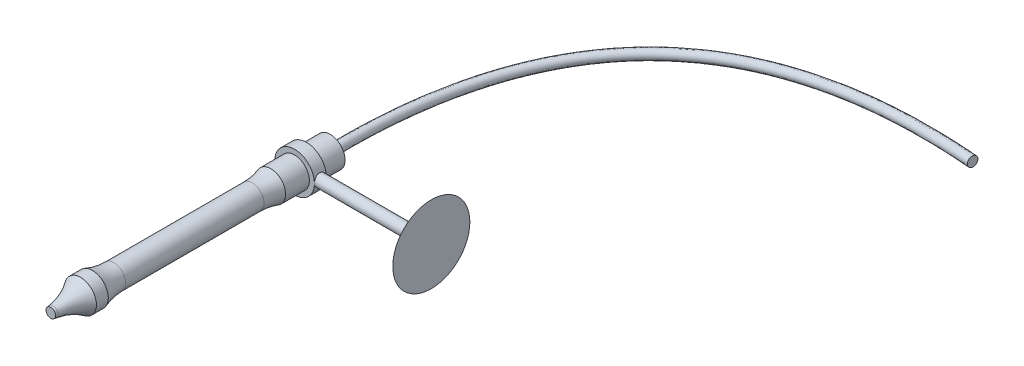
ISO-10303-21;
HEADER;
FILE_DESCRIPTION(('STEP AP214'),'2;1');
FILE_NAME('part.step','',(''),(''),'','','');
FILE_SCHEMA(('AUTOMOTIVE_DESIGN { 1 0 10303 214 1 1 1 1 }'));
ENDSEC;
DATA;
#1=APPLICATION_CONTEXT('core data for automotive mechanical design processes');
#2=APPLICATION_PROTOCOL_DEFINITION('international standard','automotive_design',2000,#1);
#3=PRODUCT_CONTEXT('',#1,'mechanical');
#4=PRODUCT('Part','Part','',(#3));
#5=PRODUCT_RELATED_PRODUCT_CATEGORY('part','',(#4));
#6=PRODUCT_DEFINITION_FORMATION('','',#4);
#7=PRODUCT_DEFINITION_CONTEXT('part definition',#1,'design');
#8=PRODUCT_DEFINITION('design','',#6,#7);
#9=PRODUCT_DEFINITION_SHAPE('','',#8);
#10=(LENGTH_UNIT() NAMED_UNIT(*) SI_UNIT(.MILLI.,.METRE.));
#11=(NAMED_UNIT(*) PLANE_ANGLE_UNIT() SI_UNIT($,.RADIAN.));
#12=(NAMED_UNIT(*) SI_UNIT($,.STERADIAN.) SOLID_ANGLE_UNIT());
#13=UNCERTAINTY_MEASURE_WITH_UNIT(LENGTH_MEASURE(1.E-05),#10,'distance_accuracy_value','');
#14=(GEOMETRIC_REPRESENTATION_CONTEXT(3) GLOBAL_UNCERTAINTY_ASSIGNED_CONTEXT((#13)) GLOBAL_UNIT_ASSIGNED_CONTEXT((#10,
#11,#12)) REPRESENTATION_CONTEXT('',''));
#15=CARTESIAN_POINT('',(0.,0.,0.));
#16=DIRECTION('',(0.,0.,1.));
#17=DIRECTION('',(1.,0.,0.));
#18=AXIS2_PLACEMENT_3D('',#15,#16,#17);
#19=CARTESIAN_POINT('',(0.,0.,4.));
#20=DIRECTION('',(0.,0.,1.));
#21=DIRECTION('',(1.,0.,0.));
#22=AXIS2_PLACEMENT_3D('',#19,#20,#21);
#23=CYLINDRICAL_SURFACE('',#22,3.33545911406675);
#24=CARTESIAN_POINT('',(0.,0.,4.));
#25=DIRECTION('',(0.,0.,-1.));
#26=DIRECTION('',(-1.,0.,0.));
#27=AXIS2_PLACEMENT_3D('',#24,#25,#26);
#28=CIRCLE('',#27,3.33545911406675);
#29=CARTESIAN_POINT('',(-3.33545911406675,0.,4.));
#30=VERTEX_POINT('',#29);
#31=EDGE_CURVE('E62',#30,#30,#28,.T.);
#32=ORIENTED_EDGE('',*,*,#31,.F.);
#33=EDGE_LOOP('',(#32));
#34=FACE_BOUND('',#33,.T.);
#35=CARTESIAN_POINT('',(0.,0.,6.));
#36=DIRECTION('',(0.,0.,-1.));
#37=DIRECTION('',(-1.,0.,0.));
#38=AXIS2_PLACEMENT_3D('',#35,#36,#37);
#39=CIRCLE('',#38,3.33545911406675);
#40=CARTESIAN_POINT('',(-3.33545911406675,0.,6.));
#41=VERTEX_POINT('',#40);
#42=EDGE_CURVE('E61',#41,#41,#39,.T.);
#43=ORIENTED_EDGE('',*,*,#42,.T.);
#44=EDGE_LOOP('',(#43));
#45=FACE_BOUND('',#44,.T.);
#46=CARTESIAN_POINT('',(3.33545911406675,0.,4.0123615803254));
#47=CARTESIAN_POINT('',(3.33545859474532,0.0542133240496529,4.01236232387684));
#48=CARTESIAN_POINT('',(3.33412468721525,0.108434184529217,4.01684020928572));
#49=CARTESIAN_POINT('',(3.32893368200549,0.215299004095399,4.03459226151468));
#50=CARTESIAN_POINT('',(3.32507577599388,0.267942452351953,4.04786924633869));
#51=CARTESIAN_POINT('',(3.31525987532415,0.370095511714682,4.08273883298903));
#52=CARTESIAN_POINT('',(3.30930493320031,0.419609555205668,4.10431935204747));
#53=CARTESIAN_POINT('',(3.295915162992,0.514316292113763,4.15513443939346));
#54=CARTESIAN_POINT('',(3.28848014949565,0.559508443066529,4.18436996678603));
#55=CARTESIAN_POINT('',(3.2726913390432,0.645555869772041,4.25052926292948));
#56=CARTESIAN_POINT('',(3.26431908206602,0.686272814123452,4.28762853201235));
#57=CARTESIAN_POINT('',(3.24771050900459,0.761007605381701,4.36808802331961));
#58=CARTESIAN_POINT('',(3.23947421528625,0.795024359974312,4.41144926442295));
#59=CARTESIAN_POINT('',(3.22387562790301,0.856114461558237,4.50436413942261));
#60=CARTESIAN_POINT('',(3.21653631853401,0.883020160804385,4.55403221935504));
#61=CARTESIAN_POINT('',(3.20383804372948,0.928041146304969,4.65744033353634));
#62=CARTESIAN_POINT('',(3.19847861665757,0.946158481994202,4.71117941505015));
#63=CARTESIAN_POINT('',(3.19053907662252,0.972591882833786,4.81965319708747));
#64=CARTESIAN_POINT('',(3.187886954268,0.981162475167788,4.87432046286353));
#65=CARTESIAN_POINT('',(3.1854479682639,0.989053755209431,4.98437632294314));
#66=CARTESIAN_POINT('',(3.18566043049727,0.988376619166253,5.03976474447351));
#67=CARTESIAN_POINT('',(3.18886271192411,0.977991844593223,5.14763132795278));
#68=CARTESIAN_POINT('',(3.19175487801695,0.968601705709039,5.20014343374472));
#69=CARTESIAN_POINT('',(3.19983290829458,0.941569905030586,5.30281084822294));
#70=CARTESIAN_POINT('',(3.20501899356802,0.923927447865862,5.35296592922286));
#71=CARTESIAN_POINT('',(3.21717940817788,0.880654971952299,5.45027836957983));
#72=CARTESIAN_POINT('',(3.22417679383611,0.854920973550015,5.49738648761944));
#73=CARTESIAN_POINT('',(3.23916013869764,0.796268204725903,5.58672277360935));
#74=CARTESIAN_POINT('',(3.24714633194111,0.763347731930148,5.62894978166258));
#75=CARTESIAN_POINT('',(3.26360477993206,0.689673939290382,5.70912766637599));
#76=CARTESIAN_POINT('',(3.27208360044128,0.648656736973535,5.74683512711562));
#77=CARTESIAN_POINT('',(3.28828403325024,0.560775574965283,5.81489214578275));
#78=CARTESIAN_POINT('',(3.29600560029437,0.51391126621399,5.84524126411412));
#79=CARTESIAN_POINT('',(3.30988897215643,0.415231866699017,5.89786278978185));
#80=CARTESIAN_POINT('',(3.3160405095211,0.363387092625176,5.92008242282251));
#81=CARTESIAN_POINT('',(3.3260167285635,0.256472291165546,5.95541562769836));
#82=CARTESIAN_POINT('',(3.32984204182267,0.201403143668695,5.96853167134033));
#83=CARTESIAN_POINT('',(3.33463543982902,0.0916731109890746,5.98488297386323));
#84=CARTESIAN_POINT('',(3.33569891673489,0.0370654964326703,5.98844825323522));
#85=CARTESIAN_POINT('',(3.33512799089891,-0.0719707270611069,5.98652015591804));
#86=CARTESIAN_POINT('',(3.33349393812181,-0.126399358301029,5.98102795430376));
#87=CARTESIAN_POINT('',(3.32777391494358,-0.232295271324664,5.96140817595549));
#88=CARTESIAN_POINT('',(3.32374243036412,-0.283801303316338,5.94747236605191));
#89=CARTESIAN_POINT('',(3.31369283249739,-0.383733818374663,5.91159069194744));
#90=CARTESIAN_POINT('',(3.3076744827287,-0.432159934043683,5.88964387422449));
#91=CARTESIAN_POINT('',(3.2941056600938,-0.525780656750882,5.83780218218657));
#92=CARTESIAN_POINT('',(3.28652346492846,-0.570876763874594,5.80773795131983));
#93=CARTESIAN_POINT('',(3.27069835550213,-0.655496754229677,5.74072147237581));
#94=CARTESIAN_POINT('',(3.26245528011169,-0.695019272042243,5.70376754158952));
#95=CARTESIAN_POINT('',(3.24587310157176,-0.768815953128473,5.62247097332805));
#96=CARTESIAN_POINT('',(3.23754088661774,-0.802855495652099,5.5779134998768));
#97=CARTESIAN_POINT('',(3.22203424603739,-0.86298936885423,5.48353809087203));
#98=CARTESIAN_POINT('',(3.2148597869735,-0.889083929013784,5.43372030731209));
#99=CARTESIAN_POINT('',(3.20256406341342,-0.932404778278876,5.33041159750006));
#100=CARTESIAN_POINT('',(3.19743285057474,-0.949674155766802,5.27693999164027));
#101=CARTESIAN_POINT('',(3.18982852883468,-0.974914655736116,5.16766826317063));
#102=CARTESIAN_POINT('',(3.18735453878674,-0.982888860611743,5.11186891882907));
#103=CARTESIAN_POINT('',(3.18543002280948,-0.989106837079643,5.00195847641877));
#104=CARTESIAN_POINT('',(3.18586086910518,-0.98773236916733,4.94787076579933));
#105=CARTESIAN_POINT('',(3.18941317481038,-0.976200136369812,4.8407345658914));
#106=CARTESIAN_POINT('',(3.19253453161151,-0.966042706441556,4.78768603705039));
#107=CARTESIAN_POINT('',(3.20103762949315,-0.937476437029475,4.68474042985967));
#108=CARTESIAN_POINT('',(3.20639231111525,-0.919166204991245,4.63481358970892));
#109=CARTESIAN_POINT('',(3.21875437264944,-0.874890678120699,4.53870078264029));
#110=CARTESIAN_POINT('',(3.22576206244756,-0.848923947711911,4.49251551933179));
#111=CARTESIAN_POINT('',(3.24095189232623,-0.788989851005709,4.40341903874876));
#112=CARTESIAN_POINT('',(3.24916695650304,-0.754770617418629,4.36068286163931));
#113=CARTESIAN_POINT('',(3.26568329629989,-0.679759336524921,4.28143555156332));
#114=CARTESIAN_POINT('',(3.27398459357433,-0.638965599013623,4.24492602435463));
#115=CARTESIAN_POINT('',(3.29001889545424,-0.550576160592224,4.17814299120523));
#116=CARTESIAN_POINT('',(3.29772924754409,-0.502820976000291,4.14807457607197));
#117=CARTESIAN_POINT('',(3.31144416480173,-0.402704738783865,4.09643638239578));
#118=CARTESIAN_POINT('',(3.31744956515563,-0.350345957793296,4.074862440747));
#119=CARTESIAN_POINT('',(3.32652213987926,-0.248676099276189,4.04286969867746));
#120=CARTESIAN_POINT('',(3.32984622601543,-0.199698039333411,4.03145958635817));
#121=CARTESIAN_POINT('',(3.33431478226766,-0.100482011016156,4.0162057779511));
#122=CARTESIAN_POINT('',(3.33545959536747,-0.050244242161485,4.01236089121107));
#123=CARTESIAN_POINT('',(3.33545911406675,0.,4.0123615803254));
#124=B_SPLINE_CURVE_WITH_KNOTS('',3,(#46,#47,#48,#49,#50,#51,#52,#53,#54,#55,#56,#57,#58,#59,
#60,#61,#62,#63,#64,#65,#66,#67,#68,#69,#70,#71,#72,#73,#74,#75,#76,#77,#78,#79,#80,#81,#82,#83,
#84,#85,#86,#87,#88,#89,#90,#91,#92,#93,#94,#95,#96,#97,#98,#99,#100,#101,#102,#103,#104,#105,
#106,#107,#108,#109,#110,#111,#112,#113,#114,#115,#116,#117,#118,#119,#120,#121,#122,#123),
.UNSPECIFIED.,.T.,.F.,(4,2,2,2,2,2,2,2,2,2,2,2,2,2,2,2,2,2,2,2,2,2,2,2,2,2,2,2,2,2,2,2,2,2,2,2,
2,2,4),(0.,0.162455450943634,0.324962955108748,0.487234877697006,0.64952714126232,
0.815917590518073,0.982335143557728,1.15238287694366,1.32239093633573,1.48774899339534,
1.65306813774909,1.81259013865982,1.97212751770235,2.13380512233315,2.2955210677378,
2.46380687081703,2.63210272501402,2.80147249638967,2.97079626247248,3.13418878121919,
3.29756010385816,3.45735326321316,3.61716544839054,3.78061099489834,3.9440965130223,
4.11335520971679,4.28260901711801,4.45102836331313,4.61939184366652,4.7809225607495,
4.94244711778646,5.10206898572496,5.26172080146197,5.42705502412562,5.59243181969801,
5.76247625113761,5.93243724047086,6.08302265673771,6.23358437123781),.UNSPECIFIED.);
#125=CARTESIAN_POINT('',(3.33545911406675,0.,4.0123615803254));
#126=VERTEX_POINT('',#125);
#127=EDGE_CURVE('E38',#126,#126,#124,.T.);
#128=ORIENTED_EDGE('',*,*,#127,.F.);
#129=EDGE_LOOP('',(#128));
#130=FACE_BOUND('',#129,.T.);
#131=ADVANCED_FACE('F34',(#34,#45,#130),#23,.T.);
#132=CARTESIAN_POINT('',(0.,0.,10.));
#133=DIRECTION('',(0.,0.,-1.));
#134=DIRECTION('',(-1.,0.,0.));
#135=AXIS2_PLACEMENT_3D('',#132,#133,#134);
#136=CYLINDRICAL_SURFACE('',#135,2.5);
#137=CARTESIAN_POINT('',(0.,0.,10.));
#138=DIRECTION('',(0.,0.,1.));
#139=DIRECTION('',(1.,0.,0.));
#140=AXIS2_PLACEMENT_3D('',#137,#138,#139);
#141=CIRCLE('',#140,2.5);
#142=CARTESIAN_POINT('',(2.5,0.,10.));
#143=VERTEX_POINT('',#142);
#144=EDGE_CURVE('E78',#143,#143,#141,.T.);
#145=ORIENTED_EDGE('',*,*,#144,.F.);
#146=EDGE_LOOP('',(#145));
#147=FACE_BOUND('',#146,.T.);
#148=CARTESIAN_POINT('',(0.,0.,6.));
#149=DIRECTION('',(0.,0.,-1.));
#150=DIRECTION('',(-1.,0.,0.));
#151=AXIS2_PLACEMENT_3D('',#148,#149,#150);
#152=CIRCLE('',#151,2.5);
#153=CARTESIAN_POINT('',(-2.5,0.,6.));
#154=VERTEX_POINT('',#153);
#155=EDGE_CURVE('E92',#154,#154,#152,.T.);
#156=ORIENTED_EDGE('',*,*,#155,.F.);
#157=EDGE_LOOP('',(#156));
#158=FACE_BOUND('',#157,.T.);
#159=ADVANCED_FACE('F109',(#147,#158),#136,.T.);
#160=CARTESIAN_POINT('',(0.,0.,40.));
#161=DIRECTION('',(0.,0.,-1.));
#162=DIRECTION('',(-1.,0.,0.));
#163=AXIS2_PLACEMENT_3D('',#160,#161,#162);
#164=CYLINDRICAL_SURFACE('',#163,2.);
#165=CARTESIAN_POINT('',(0.,0.,36.394285056652));
#166=DIRECTION('',(0.,0.,1.));
#167=DIRECTION('',(1.,0.,0.));
#168=AXIS2_PLACEMENT_3D('',#165,#166,#167);
#169=CIRCLE('',#168,2.);
#170=CARTESIAN_POINT('',(2.,0.,36.394285056652));
#171=VERTEX_POINT('',#170);
#172=EDGE_CURVE('E89',#171,#171,#169,.F.);
#173=ORIENTED_EDGE('',*,*,#172,.T.);
#174=EDGE_LOOP('',(#173));
#175=FACE_BOUND('',#174,.T.);
#176=CARTESIAN_POINT('',(0.,0.,13.1224989991992));
#177=DIRECTION('',(0.,0.,-1.));
#178=DIRECTION('',(-1.,0.,0.));
#179=AXIS2_PLACEMENT_3D('',#176,#177,#178);
#180=CIRCLE('',#179,2.);
#181=CARTESIAN_POINT('',(-2.,0.,13.1224989991992));
#182=VERTEX_POINT('',#181);
#183=EDGE_CURVE('E81',#182,#182,#180,.F.);
#184=ORIENTED_EDGE('',*,*,#183,.T.);
#185=EDGE_LOOP('',(#184));
#186=FACE_BOUND('',#185,.T.);
#187=ADVANCED_FACE('F148',(#175,#186),#164,.T.);
#188=CARTESIAN_POINT('',(0.,0.,42.));
#189=DIRECTION('',(0.,0.,-1.));
#190=DIRECTION('',(-1.,0.,0.));
#191=AXIS2_PLACEMENT_3D('',#188,#189,#190);
#192=CYLINDRICAL_SURFACE('',#191,2.67268421531054);
#193=CARTESIAN_POINT('',(0.,0.,42.));
#194=DIRECTION('',(0.,0.,1.));
#195=DIRECTION('',(1.,0.,0.));
#196=AXIS2_PLACEMENT_3D('',#193,#194,#195);
#197=CIRCLE('',#196,2.67268421531054);
#198=CARTESIAN_POINT('',(2.67268421531054,0.,42.));
#199=VERTEX_POINT('',#198);
#200=EDGE_CURVE('E72',#199,#199,#197,.T.);
#201=ORIENTED_EDGE('',*,*,#200,.F.);
#202=EDGE_LOOP('',(#201));
#203=FACE_BOUND('',#202,.T.);
#204=CARTESIAN_POINT('',(0.,0.,40.));
#205=DIRECTION('',(0.,0.,1.));
#206=DIRECTION('',(1.,0.,0.));
#207=AXIS2_PLACEMENT_3D('',#204,#205,#206);
#208=CIRCLE('',#207,2.67268421531054);
#209=CARTESIAN_POINT('',(2.67268421531054,0.,40.));
#210=VERTEX_POINT('',#209);
#211=EDGE_CURVE('E71',#210,#210,#208,.T.);
#212=ORIENTED_EDGE('',*,*,#211,.T.);
#213=EDGE_LOOP('',(#212));
#214=FACE_BOUND('',#213,.T.);
#215=ADVANCED_FACE('F144',(#203,#214),#192,.T.);
#216=CARTESIAN_POINT('',(0.,0.,42.));
#217=DIRECTION('',(0.,0.,-1.));
#218=DIRECTION('',(1.,0.,0.));
#219=AXIS2_PLACEMENT_3D('',#216,#217,#218);
#220=CONICAL_SURFACE('',#219,1.4240416063004,0.122173047639603);
#221=CARTESIAN_POINT('',(0.,0.,46.6349250458601));
#222=DIRECTION('',(0.,0.,1.));
#223=DIRECTION('',(1.,0.,0.));
#224=AXIS2_PLACEMENT_3D('',#221,#222,#223);
#225=CIRCLE('',#224,0.854944369726588);
#226=CARTESIAN_POINT('',(0.854944369726588,0.,46.6349250458601));
#227=VERTEX_POINT('',#226);
#228=EDGE_CURVE('E86',#227,#227,#225,.T.);
#229=ORIENTED_EDGE('',*,*,#228,.T.);
#230=EDGE_LOOP('',(#229));
#231=FACE_BOUND('',#230,.T.);
#232=CARTESIAN_POINT('',(0.,0.,47.));
#233=DIRECTION('',(0.,0.,1.));
#234=DIRECTION('',(1.,0.,0.));
#235=AXIS2_PLACEMENT_3D('',#232,#233,#234);
#236=CIRCLE('',#235,0.810118801785874);
#237=CARTESIAN_POINT('',(0.810118801785874,0.,47.));
#238=VERTEX_POINT('',#237);
#239=EDGE_CURVE('E68',#238,#238,#236,.T.);
#240=ORIENTED_EDGE('',*,*,#239,.F.);
#241=EDGE_LOOP('',(#240));
#242=FACE_BOUND('',#241,.T.);
#243=ADVANCED_FACE('F140',(#231,#242),#220,.T.);
#244=CARTESIAN_POINT('',(0.,0.,47.));
#245=DIRECTION('',(0.,0.,1.));
#246=DIRECTION('',(1.,0.,0.));
#247=AXIS2_PLACEMENT_3D('',#244,#245,#246);
#248=PLANE('',#247);
#249=ORIENTED_EDGE('',*,*,#239,.T.);
#250=EDGE_LOOP('',(#249));
#251=FACE_BOUND('',#250,.T.);
#252=ADVANCED_FACE('F136',(#251),#248,.T.);
#253=CARTESIAN_POINT('',(0.,0.,13.1224989991992));
#254=DIRECTION('',(0.,0.,-1.));
#255=DIRECTION('',(-1.,0.,0.));
#256=AXIS2_PLACEMENT_3D('',#253,#254,#255);
#257=TOROIDAL_SURFACE('',#256,12.,10.);
#258=ORIENTED_EDGE('',*,*,#144,.T.);
#259=EDGE_LOOP('',(#258));
#260=FACE_BOUND('',#259,.T.);
#261=ORIENTED_EDGE('',*,*,#183,.F.);
#262=EDGE_LOOP('',(#261));
#263=FACE_BOUND('',#262,.T.);
#264=ADVANCED_FACE('F139',(#260,#263),#257,.F.);
#265=CARTESIAN_POINT('',(0.,0.,47.8536184799116));
#266=DIRECTION('',(0.,0.,-1.));
#267=DIRECTION('',(-1.,0.,0.));
#268=AXIS2_PLACEMENT_3D('',#265,#266,#267);
#269=TOROIDAL_SURFACE('',#268,10.7804058861398,10.);
#270=ORIENTED_EDGE('',*,*,#200,.T.);
#271=EDGE_LOOP('',(#270));
#272=FACE_BOUND('',#271,.T.);
#273=ORIENTED_EDGE('',*,*,#228,.F.);
#274=EDGE_LOOP('',(#273));
#275=FACE_BOUND('',#274,.T.);
#276=ADVANCED_FACE('F157',(#272,#275),#269,.F.);
#277=CARTESIAN_POINT('',(0.,0.,36.394285056652));
#278=DIRECTION('',(0.,0.,1.));
#279=DIRECTION('',(1.,0.,0.));
#280=AXIS2_PLACEMENT_3D('',#277,#278,#279);
#281=TOROIDAL_SURFACE('',#280,12.,10.);
#282=ORIENTED_EDGE('',*,*,#172,.F.);
#283=EDGE_LOOP('',(#282));
#284=FACE_BOUND('',#283,.T.);
#285=ORIENTED_EDGE('',*,*,#211,.F.);
#286=EDGE_LOOP('',(#285));
#287=FACE_BOUND('',#286,.T.);
#288=ADVANCED_FACE('F36',(#284,#287),#281,.F.);
#289=CARTESIAN_POINT('',(0.,0.,4.));
#290=DIRECTION('',(0.,0.,-1.));
#291=DIRECTION('',(-1.,0.,0.));
#292=AXIS2_PLACEMENT_3D('',#289,#290,#291);
#293=PLANE('',#292);
#294=CARTESIAN_POINT('',(0.,0.,4.));
#295=DIRECTION('',(0.,0.,-1.));
#296=DIRECTION('',(-1.,0.,0.));
#297=AXIS2_PLACEMENT_3D('',#294,#295,#296);
#298=CIRCLE('',#297,2.5);
#299=CARTESIAN_POINT('',(-2.5,0.,4.));
#300=VERTEX_POINT('',#299);
#301=EDGE_CURVE('E65',#300,#300,#298,.T.);
#302=ORIENTED_EDGE('',*,*,#301,.F.);
#303=EDGE_LOOP('',(#302));
#304=FACE_BOUND('',#303,.T.);
#305=ORIENTED_EDGE('',*,*,#31,.T.);
#306=EDGE_LOOP('',(#305));
#307=FACE_BOUND('',#306,.T.);
#308=ADVANCED_FACE('F100',(#304,#307),#293,.T.);
#309=CARTESIAN_POINT('',(0.,0.,6.));
#310=DIRECTION('',(0.,0.,-1.));
#311=DIRECTION('',(-1.,0.,0.));
#312=AXIS2_PLACEMENT_3D('',#309,#310,#311);
#313=PLANE('',#312);
#314=ORIENTED_EDGE('',*,*,#155,.T.);
#315=EDGE_LOOP('',(#314));
#316=FACE_BOUND('',#315,.T.);
#317=ORIENTED_EDGE('',*,*,#42,.F.);
#318=EDGE_LOOP('',(#317));
#319=FACE_BOUND('',#318,.T.);
#320=ADVANCED_FACE('F103',(#316,#319),#313,.F.);
#321=CARTESIAN_POINT('',(0.,0.,0.));
#322=DIRECTION('',(0.,0.,1.));
#323=DIRECTION('',(1.,0.,0.));
#324=AXIS2_PLACEMENT_3D('',#321,#322,#323);
#325=PLANE('',#324);
#326=CARTESIAN_POINT('',(0.,0.,0.));
#327=DIRECTION('',(0.,0.,-1.));
#328=DIRECTION('',(-1.,0.,0.));
#329=AXIS2_PLACEMENT_3D('',#326,#327,#328);
#330=CIRCLE('',#329,0.823056941418801);
#331=CARTESIAN_POINT('',(-0.823056941418801,0.,0.));
#332=VERTEX_POINT('',#331);
#333=EDGE_CURVE('E11',#332,#332,#330,.T.);
#334=ORIENTED_EDGE('',*,*,#333,.F.);
#335=EDGE_LOOP('',(#334));
#336=FACE_BOUND('',#335,.T.);
#337=CARTESIAN_POINT('',(0.,0.,0.));
#338=DIRECTION('',(0.,0.,1.));
#339=DIRECTION('',(1.,0.,0.));
#340=AXIS2_PLACEMENT_3D('',#337,#338,#339);
#341=CIRCLE('',#340,2.5);
#342=CARTESIAN_POINT('',(2.5,0.,0.));
#343=VERTEX_POINT('',#342);
#344=EDGE_CURVE('E75',#343,#343,#341,.T.);
#345=ORIENTED_EDGE('',*,*,#344,.F.);
#346=EDGE_LOOP('',(#345));
#347=FACE_BOUND('',#346,.T.);
#348=ADVANCED_FACE('F126',(#336,#347),#325,.F.);
#349=ORIENTED_EDGE('',*,*,#301,.T.);
#350=EDGE_LOOP('',(#349));
#351=FACE_BOUND('',#350,.T.);
#352=ORIENTED_EDGE('',*,*,#344,.T.);
#353=EDGE_LOOP('',(#352));
#354=FACE_BOUND('',#353,.T.);
#355=ADVANCED_FACE('F97',(#351,#354),#136,.T.);
#356=CARTESIAN_POINT('',(20.,0.,5.));
#357=DIRECTION('',(-1.,0.,0.));
#358=DIRECTION('',(0.,0.,1.));
#359=AXIS2_PLACEMENT_3D('',#356,#357,#358);
#360=CYLINDRICAL_SURFACE('',#359,0.987638419674596);
#361=CARTESIAN_POINT('',(20.,0.,5.));
#362=DIRECTION('',(1.,0.,0.));
#363=DIRECTION('',(0.,0.,-1.));
#364=AXIS2_PLACEMENT_3D('',#361,#362,#363);
#365=CIRCLE('',#364,0.987638419674596);
#366=CARTESIAN_POINT('',(20.,0.,4.01236158032541));
#367=VERTEX_POINT('',#366);
#368=EDGE_CURVE('E56',#367,#367,#365,.T.);
#369=ORIENTED_EDGE('',*,*,#368,.F.);
#370=EDGE_LOOP('',(#369));
#371=FACE_BOUND('',#370,.T.);
#372=ORIENTED_EDGE('',*,*,#127,.T.);
#373=EDGE_LOOP('',(#372));
#374=FACE_BOUND('',#373,.T.);
#375=ADVANCED_FACE('F115',(#371,#374),#360,.T.);
#376=CARTESIAN_POINT('',(20.,0.,5.));
#377=DIRECTION('',(1.,0.,0.));
#378=DIRECTION('',(0.,0.,-1.));
#379=AXIS2_PLACEMENT_3D('',#376,#377,#378);
#380=CONICAL_SURFACE('',#379,0.987638419674596,1.22173047639603);
#381=CARTESIAN_POINT('',(22.,0.,5.));
#382=DIRECTION('',(1.,0.,0.));
#383=DIRECTION('',(0.,0.,-1.));
#384=AXIS2_PLACEMENT_3D('',#381,#382,#383);
#385=CIRCLE('',#384,6.48259325858386);
#386=CARTESIAN_POINT('',(22.,0.,-1.48259325858385));
#387=VERTEX_POINT('',#386);
#388=EDGE_CURVE('E53',#387,#387,#385,.T.);
#389=CARTESIAN_POINT('',(22.,0.,-1.48259325858385));
#390=CARTESIAN_POINT('',(21.9791666666667,0.,-1.42535414567855));
#391=CARTESIAN_POINT('',(21.9583333333333,0.,-1.36811503277324));
#392=CARTESIAN_POINT('',(21.9166666666667,0.,-1.25363680696263));
#393=CARTESIAN_POINT('',(21.8958333333333,0.,-1.19639769405733));
#394=CARTESIAN_POINT('',(21.8541666666667,0.,-1.08191946824672));
#395=CARTESIAN_POINT('',(21.8333333333333,0.,-1.02468035534141));
#396=CARTESIAN_POINT('',(21.7916666666667,0.,-0.910202129530804));
#397=CARTESIAN_POINT('',(21.7708333333333,0.,-0.8529630166255));
#398=CARTESIAN_POINT('',(21.7291666666667,0.,-0.73848479081489));
#399=CARTESIAN_POINT('',(21.7083333333333,0.,-0.681245677909585));
#400=CARTESIAN_POINT('',(21.6666666666667,0.,-0.566767452098975));
#401=CARTESIAN_POINT('',(21.6458333333333,0.,-0.50952833919367));
#402=CARTESIAN_POINT('',(21.6041666666667,0.,-0.395050113383061));
#403=CARTESIAN_POINT('',(21.5833333333333,0.,-0.337811000477756));
#404=CARTESIAN_POINT('',(21.5416666666667,0.,-0.223332774667147));
#405=CARTESIAN_POINT('',(21.5208333333333,0.,-0.166093661761842));
#406=CARTESIAN_POINT('',(21.4791666666667,0.,-0.0516154359512319));
#407=CARTESIAN_POINT('',(21.4583333333333,0.,0.00562367695407298));
#408=CARTESIAN_POINT('',(21.4166666666667,0.,0.120101902764683));
#409=CARTESIAN_POINT('',(21.3958333333333,0.,0.177341015669987));
#410=CARTESIAN_POINT('',(21.3541666666667,0.,0.291819241480596));
#411=CARTESIAN_POINT('',(21.3333333333333,0.,0.349058354385901));
#412=CARTESIAN_POINT('',(21.2916666666667,0.,0.463536580196511));
#413=CARTESIAN_POINT('',(21.2708333333333,0.,0.520775693101815));
#414=CARTESIAN_POINT('',(21.2291666666667,0.,0.635253918912425));
#415=CARTESIAN_POINT('',(21.2083333333333,0.,0.69249303181773));
#416=CARTESIAN_POINT('',(21.1666666666667,0.,0.80697125762834));
#417=CARTESIAN_POINT('',(21.1458333333333,0.,0.864210370533644));
#418=CARTESIAN_POINT('',(21.1041666666667,0.,0.978688596344254));
#419=CARTESIAN_POINT('',(21.0833333333333,0.,1.03592770924956));
#420=CARTESIAN_POINT('',(21.0416666666667,0.,1.15040593506017));
#421=CARTESIAN_POINT('',(21.0208333333333,0.,1.20764504796547));
#422=CARTESIAN_POINT('',(20.9791666666667,0.,1.32212327377608));
#423=CARTESIAN_POINT('',(20.9583333333333,0.,1.37936238668139));
#424=CARTESIAN_POINT('',(20.9166666666667,0.,1.493840612492));
#425=CARTESIAN_POINT('',(20.8958333333333,0.,1.5510797253973));
#426=CARTESIAN_POINT('',(20.8541666666667,0.,1.66555795120791));
#427=CARTESIAN_POINT('',(20.8333333333333,0.,1.72279706411322));
#428=CARTESIAN_POINT('',(20.7916666666667,0.,1.83727528992383));
#429=CARTESIAN_POINT('',(20.7708333333333,0.,1.89451440282913));
#430=CARTESIAN_POINT('',(20.7291666666667,0.,2.00899262863974));
#431=CARTESIAN_POINT('',(20.7083333333333,0.,2.06623174154505));
#432=CARTESIAN_POINT('',(20.6666666666667,0.,2.18070996735565));
#433=CARTESIAN_POINT('',(20.6458333333333,0.,2.23794908026096));
#434=CARTESIAN_POINT('',(20.6041666666667,0.,2.35242730607157));
#435=CARTESIAN_POINT('',(20.5833333333333,0.,2.40966641897687));
#436=CARTESIAN_POINT('',(20.5416666666667,0.,2.52414464478748));
#437=CARTESIAN_POINT('',(20.5208333333333,0.,2.58138375769279));
#438=CARTESIAN_POINT('',(20.4791666666667,0.,2.6958619835034));
#439=CARTESIAN_POINT('',(20.4583333333333,0.,2.7531010964087));
#440=CARTESIAN_POINT('',(20.4166666666667,0.,2.86757932221931));
#441=CARTESIAN_POINT('',(20.3958333333333,0.,2.92481843512462));
#442=CARTESIAN_POINT('',(20.3541666666667,0.,3.03929666093523));
#443=CARTESIAN_POINT('',(20.3333333333333,0.,3.09653577384053));
#444=CARTESIAN_POINT('',(20.2916666666667,0.,3.21101399965114));
#445=CARTESIAN_POINT('',(20.2708333333333,0.,3.26825311255645));
#446=CARTESIAN_POINT('',(20.2291666666667,0.,3.38273133836706));
#447=CARTESIAN_POINT('',(20.2083333333333,0.,3.43997045127236));
#448=CARTESIAN_POINT('',(20.1666666666667,0.,3.55444867708297));
#449=CARTESIAN_POINT('',(20.1458333333333,0.,3.61168778998828));
#450=CARTESIAN_POINT('',(20.1041666666667,0.,3.72616601579888));
#451=CARTESIAN_POINT('',(20.0833333333333,0.,3.78340512870419));
#452=CARTESIAN_POINT('',(20.0416666666667,0.,3.8978833545148));
#453=CARTESIAN_POINT('',(20.0208333333333,0.,3.9551224674201));
#454=CARTESIAN_POINT('',(20.,0.,4.01236158032541));
#455=B_SPLINE_CURVE_WITH_KNOTS('',3,(#389,#390,#391,#392,#393,#394,#395,#396,#397,#398,#399,
#400,#401,#402,#403,#404,#405,#406,#407,#408,#409,#410,#411,#412,#413,#414,#415,#416,#417,#418,
#419,#420,#421,#422,#423,#424,#425,#426,#427,#428,#429,#430,#431,#432,#433,#434,#435,#436,#437,
#438,#439,#440,#441,#442,#443,#444,#445,#446,#447,#448,#449,#450,#451,#452,#453,#454),
.UNSPECIFIED.,.F.,.F.,(4,2,2,2,2,2,2,2,2,2,2,2,2,2,2,2,2,2,2,2,2,2,2,2,2,2,2,2,2,2,2,2,4),(0.,
0.182737775010194,0.365475550020387,0.548213325030581,0.730951100040773,0.913688875050967,
1.09642665006116,1.27916442507135,1.46190220008155,1.64463997509174,1.82737775010193,
2.01011552511213,2.19285330012232,2.37559107513251,2.55832885014271,2.7410666251529,
2.9238044001631,3.10654217517329,3.28927995018348,3.47201772519367,3.65475550020387,
3.83749327521406,4.02023105022425,4.20296882523445,4.38570660024464,4.56844437525484,
4.75118215026503,4.93391992527522,5.11665770028542,5.29939547529561,5.4821332503058,
5.664871025316,5.84760880032619),.UNSPECIFIED.);
#456=EDGE_CURVE('BSEAM117',#387,#367,#455,.T.);
#457=ORIENTED_EDGE('',*,*,#388,.F.);
#458=ORIENTED_EDGE('',*,*,#368,.T.);
#459=ORIENTED_EDGE('',*,*,#456,.T.);
#460=ORIENTED_EDGE('',*,*,#456,.F.);
#461=EDGE_LOOP('',(#457,#459,#458,#460));
#462=FACE_BOUND('',#461,.T.);
#463=ADVANCED_FACE('F117',(#462),#380,.T.);
#464=CARTESIAN_POINT('',(22.,0.,5.));
#465=DIRECTION('',(1.,0.,0.));
#466=DIRECTION('',(0.,0.,-1.));
#467=AXIS2_PLACEMENT_3D('',#464,#465,#466);
#468=PLANE('',#467);
#469=ORIENTED_EDGE('',*,*,#388,.T.);
#470=EDGE_LOOP('',(#469));
#471=FACE_BOUND('',#470,.T.);
#472=ADVANCED_FACE('F123',(#471),#468,.T.);
#473=CARTESIAN_POINT('',(55.4731266351647,0.,-52.5785864035224));
#474=DIRECTION('',(0.994894215806792,0.,0.10092323495701));
#475=DIRECTION('',(0.10092323495701,0.,-0.994894215806792));
#476=AXIS2_PLACEMENT_3D('',#473,#474,#475);
#477=PLANE('',#476);
#478=CARTESIAN_POINT('',(55.4731266351647,0.,-52.5785864035224));
#479=DIRECTION('',(0.994894215806792,0.,0.10092323495701));
#480=DIRECTION('',(0.10092323495701,0.,-0.994894215806792));
#481=AXIS2_PLACEMENT_3D('',#478,#479,#480);
#482=CIRCLE('',#481,0.823056941418801);
#483=CARTESIAN_POINT('',(55.5561922042465,0.,-53.3974409938196));
#484=VERTEX_POINT('',#483);
#485=EDGE_CURVE('E50',#484,#484,#482,.T.);
#486=ORIENTED_EDGE('',*,*,#485,.T.);
#487=EDGE_LOOP('',(#486));
#488=FACE_BOUND('',#487,.T.);
#489=ADVANCED_FACE('F51',(#488),#477,.T.);
#490=CARTESIAN_POINT('',(-0.823056941418801,0.,0.));
#491=CARTESIAN_POINT('',(-1.00528514868458,0.,-9.60549848291007));
#492=CARTESIAN_POINT('',(0.0204274545560473,0.,-17.9424398413057));
#493=CARTESIAN_POINT('',(4.53528441007579,0.,-32.0802969077914));
#494=CARTESIAN_POINT('',(8.03201383470082,0.,-37.882374219091));
#495=CARTESIAN_POINT('',(17.5018181728053,0.,-46.8500622553068));
#496=CARTESIAN_POINT('',(23.4650720689064,0.,-50.006212498284));
#497=CARTESIAN_POINT('',(37.7434076421809,0.,-53.6668925612425));
#498=CARTESIAN_POINT('',(46.0599789416722,0.,-54.1791215015874));
#499=CARTESIAN_POINT('',(55.5561922042465,0.,-53.3974409938196));
#500=CARTESIAN_POINT('',(-0.823056941418801,1.6461138828376,0.));
#501=CARTESIAN_POINT('',(-1.00528514868458,1.6461138828376,-9.60549848291007));
#502=CARTESIAN_POINT('',(0.0204274545560473,1.6461138828376,-17.9424398413057));
#503=CARTESIAN_POINT('',(4.53528441007579,1.6461138828376,-32.0802969077914));
#504=CARTESIAN_POINT('',(8.03201383470082,1.6461138828376,-37.882374219091));
#505=CARTESIAN_POINT('',(17.5018181728053,1.6461138828376,-46.8500622553068));
#506=CARTESIAN_POINT('',(23.4650720689064,1.6461138828376,-50.006212498284));
#507=CARTESIAN_POINT('',(37.7434076421809,1.6461138828376,-53.6668925612425));
#508=CARTESIAN_POINT('',(46.0599789416722,1.6461138828376,-54.1791215015874));
#509=CARTESIAN_POINT('',(55.5561922042465,1.6461138828376,-53.3974409938196));
#510=CARTESIAN_POINT('',(0.823056941418801,1.6461138828376,0.));
#511=CARTESIAN_POINT('',(0.640828734178876,1.6461138828376,-9.47016787390358));
#512=CARTESIAN_POINT('',(1.65315409652762,1.6461138828376,-17.6307507165661));
#513=CARTESIAN_POINT('',(6.01936183236701,1.6461138828376,-31.3316577408789));
#514=CARTESIAN_POINT('',(9.36565913351412,1.6461138828376,-36.8708203192069));
#515=CARTESIAN_POINT('',(18.3868970071248,1.6461138828376,-45.4293277507996));
#516=CARTESIAN_POINT('',(24.0716585969764,1.6461138828376,-48.4581330859659));
#517=CARTESIAN_POINT('',(37.8943427557921,1.6461138828376,-52.0110798680946));
#518=CARTESIAN_POINT('',(46.030775702527,1.6461138828376,-52.5275221943615));
#519=CARTESIAN_POINT('',(55.3900610660828,1.6461138828376,-51.7597318132252));
#520=CARTESIAN_POINT('',(0.823056941418801,0.,0.));
#521=CARTESIAN_POINT('',(0.640828734178876,0.,-9.47016787390358));
#522=CARTESIAN_POINT('',(1.65315409652762,0.,-17.6307507165661));
#523=CARTESIAN_POINT('',(6.01936183236701,0.,-31.3316577408789));
#524=CARTESIAN_POINT('',(9.36565913351412,0.,-36.8708203192069));
#525=CARTESIAN_POINT('',(18.3868970071248,0.,-45.4293277507996));
#526=CARTESIAN_POINT('',(24.0716585969764,0.,-48.4581330859659));
#527=CARTESIAN_POINT('',(37.8943427557921,0.,-52.0110798680946));
#528=CARTESIAN_POINT('',(46.030775702527,0.,-52.5275221943615));
#529=CARTESIAN_POINT('',(55.3900610660828,0.,-51.7597318132252));
#530=CARTESIAN_POINT('',(0.823056941418802,-1.6461138828376,0.));
#531=CARTESIAN_POINT('',(0.640828734178876,-1.6461138828376,-9.47016787390358));
#532=CARTESIAN_POINT('',(1.65315409652762,-1.6461138828376,-17.6307507165661));
#533=CARTESIAN_POINT('',(6.01936183236701,-1.6461138828376,-31.3316577408789));
#534=CARTESIAN_POINT('',(9.36565913351412,-1.6461138828376,-36.8708203192069));
#535=CARTESIAN_POINT('',(18.3868970071248,-1.6461138828376,-45.4293277507996));
#536=CARTESIAN_POINT('',(24.0716585969764,-1.6461138828376,-48.4581330859659));
#537=CARTESIAN_POINT('',(37.8943427557921,-1.6461138828376,-52.0110798680946));
#538=CARTESIAN_POINT('',(46.030775702527,-1.6461138828376,-52.5275221943615));
#539=CARTESIAN_POINT('',(55.3900610660828,-1.6461138828376,-51.7597318132252));
#540=CARTESIAN_POINT('',(-0.823056941418801,-1.6461138828376,0.));
#541=CARTESIAN_POINT('',(-1.00528514868458,-1.6461138828376,-9.60549848291007));
#542=CARTESIAN_POINT('',(0.0204274545560473,-1.6461138828376,-17.9424398413057));
#543=CARTESIAN_POINT('',(4.53528441007579,-1.6461138828376,-32.0802969077914));
#544=CARTESIAN_POINT('',(8.03201383470082,-1.6461138828376,-37.882374219091));
#545=CARTESIAN_POINT('',(17.5018181728053,-1.6461138828376,-46.8500622553068));
#546=CARTESIAN_POINT('',(23.4650720689064,-1.6461138828376,-50.006212498284));
#547=CARTESIAN_POINT('',(37.7434076421809,-1.6461138828376,-53.6668925612425));
#548=CARTESIAN_POINT('',(46.0599789416722,-1.6461138828376,-54.1791215015874));
#549=CARTESIAN_POINT('',(55.5561922042465,-1.6461138828376,-53.3974409938196));
#550=CARTESIAN_POINT('',(-0.823056941418801,0.,0.));
#551=CARTESIAN_POINT('',(-1.00528514868458,0.,-9.60549848291007));
#552=CARTESIAN_POINT('',(0.0204274545560473,0.,-17.9424398413057));
#553=CARTESIAN_POINT('',(4.53528441007579,0.,-32.0802969077914));
#554=CARTESIAN_POINT('',(8.03201383470082,0.,-37.882374219091));
#555=CARTESIAN_POINT('',(17.5018181728053,0.,-46.8500622553068));
#556=CARTESIAN_POINT('',(23.4650720689064,0.,-50.006212498284));
#557=CARTESIAN_POINT('',(37.7434076421809,0.,-53.6668925612425));
#558=CARTESIAN_POINT('',(46.0599789416722,0.,-54.1791215015874));
#559=CARTESIAN_POINT('',(55.5561922042465,0.,-53.3974409938196));
#560=(BOUNDED_SURFACE() B_SPLINE_SURFACE(3,3,((#490,#491,#492,#493,#494,#495,#496,#497,#498,
#499),(#500,#501,#502,#503,#504,#505,#506,#507,#508,#509),(#510,#511,#512,#513,#514,#515,#516,
#517,#518,#519),(#520,#521,#522,#523,#524,#525,#526,#527,#528,#529),(#530,#531,#532,#533,#534,
#535,#536,#537,#538,#539),(#540,#541,#542,#543,#544,#545,#546,#547,#548,#549),(#550,#551,#552,
#553,#554,#555,#556,#557,#558,#559)),.UNSPECIFIED.,.T.,.F.,.F.) B_SPLINE_SURFACE_WITH_KNOTS((4,
3,4),(4,2,2,2,4),(0.,0.5,1.),(0.,0.25,0.5,0.75,1.),
.UNSPECIFIED.) GEOMETRIC_REPRESENTATION_ITEM() RATIONAL_B_SPLINE_SURFACE(((1.,1.,1.,1.,1.,1.,1.,
1.,1.,1.),(0.333333333333333,0.333333333333333,0.333333333333333,0.333333333333333,
0.333333333333333,0.333333333333333,0.333333333333333,0.333333333333333,0.333333333333333,
0.333333333333333),(0.333333333333333,0.333333333333333,0.333333333333333,0.333333333333333,
0.333333333333333,0.333333333333333,0.333333333333333,0.333333333333333,0.333333333333333,
0.333333333333333),(1.,1.,1.,1.,1.,1.,1.,1.,1.,1.),(0.333333333333333,0.333333333333333,
0.333333333333333,0.333333333333333,0.333333333333333,0.333333333333333,0.333333333333333,
0.333333333333333,0.333333333333333,0.333333333333333),(0.333333333333333,0.333333333333333,
0.333333333333333,0.333333333333333,0.333333333333333,0.333333333333333,0.333333333333333,
0.333333333333333,0.333333333333333,0.333333333333333),(1.,1.,1.,1.,1.,1.,1.,1.,1.,1.))) REPRESENTATION_ITEM('') SURFACE());
#561=ORIENTED_EDGE('',*,*,#485,.F.);
#562=EDGE_LOOP('',(#561));
#563=FACE_BOUND('',#562,.T.);
#564=ORIENTED_EDGE('',*,*,#333,.T.);
#565=EDGE_LOOP('',(#564));
#566=FACE_BOUND('',#565,.T.);
#567=ADVANCED_FACE('F229',(#563,#566),#560,.T.);
#568=CLOSED_SHELL('',(#131,#159,#187,#215,#243,#252,#264,#276,#288,#308,#320,#348,#355,#375,
#463,#472,#489,#567));
#569=MANIFOLD_SOLID_BREP('B2',#568);
#570=ADVANCED_BREP_SHAPE_REPRESENTATION('',(#18,#569),#14);
#571=SHAPE_DEFINITION_REPRESENTATION(#9,#570);
ENDSEC;
END-ISO-10303-21;
